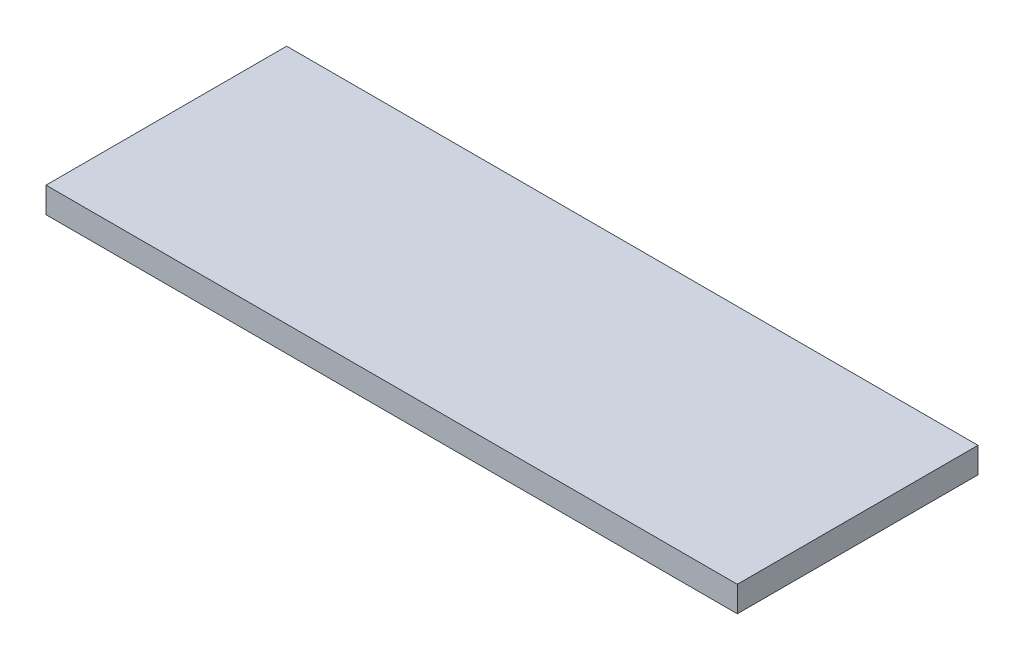
ISO-10303-21;
HEADER;
FILE_DESCRIPTION(('STEP AP214'),'2;1');
FILE_NAME('part.step','',(''),(''),'','','');
FILE_SCHEMA(('AUTOMOTIVE_DESIGN { 1 0 10303 214 1 1 1 1 }'));
ENDSEC;
DATA;
#1=APPLICATION_CONTEXT('core data for automotive mechanical design processes');
#2=APPLICATION_PROTOCOL_DEFINITION('international standard','automotive_design',2000,#1);
#3=PRODUCT_CONTEXT('',#1,'mechanical');
#4=PRODUCT('Part','Part','',(#3));
#5=PRODUCT_RELATED_PRODUCT_CATEGORY('part','',(#4));
#6=PRODUCT_DEFINITION_FORMATION('','',#4);
#7=PRODUCT_DEFINITION_CONTEXT('part definition',#1,'design');
#8=PRODUCT_DEFINITION('design','',#6,#7);
#9=PRODUCT_DEFINITION_SHAPE('','',#8);
#10=(LENGTH_UNIT() NAMED_UNIT(*) SI_UNIT(.MILLI.,.METRE.));
#11=(NAMED_UNIT(*) PLANE_ANGLE_UNIT() SI_UNIT($,.RADIAN.));
#12=(NAMED_UNIT(*) SI_UNIT($,.STERADIAN.) SOLID_ANGLE_UNIT());
#13=UNCERTAINTY_MEASURE_WITH_UNIT(LENGTH_MEASURE(1.E-05),#10,'distance_accuracy_value','');
#14=(GEOMETRIC_REPRESENTATION_CONTEXT(3) GLOBAL_UNCERTAINTY_ASSIGNED_CONTEXT((#13)) GLOBAL_UNIT_ASSIGNED_CONTEXT((#10,
#11,#12)) REPRESENTATION_CONTEXT('',''));
#15=CARTESIAN_POINT('',(0.,0.,0.));
#16=DIRECTION('',(0.,0.,1.));
#17=DIRECTION('',(1.,0.,0.));
#18=AXIS2_PLACEMENT_3D('',#15,#16,#17);
#19=CARTESIAN_POINT('',(-81.,6.00000000000001,-28.2));
#20=DIRECTION('',(0.,0.,-1.));
#21=DIRECTION('',(-1.,0.,0.));
#22=AXIS2_PLACEMENT_3D('',#19,#20,#21);
#23=PLANE('',#22);
#24=DIRECTION('',(1.,0.,0.));
#25=VECTOR('',#24,1.);
#26=CARTESIAN_POINT('',(-81.,0.,-28.2));
#27=LINE('',#26,#25);
#28=CARTESIAN_POINT('',(-81.,0.,-28.2));
#29=VERTEX_POINT('',#28);
#30=CARTESIAN_POINT('',(81.,0.,-28.2));
#31=VERTEX_POINT('',#30);
#32=EDGE_CURVE('E113',#29,#31,#27,.T.);
#33=ORIENTED_EDGE('',*,*,#32,.F.);
#34=DIRECTION('',(0.,-1.,0.));
#35=VECTOR('',#34,1.);
#36=CARTESIAN_POINT('',(-81.,6.00000000000001,-28.2));
#37=LINE('',#36,#35);
#38=CARTESIAN_POINT('',(-81.,6.00000000000001,-28.2));
#39=VERTEX_POINT('',#38);
#40=EDGE_CURVE('E11',#39,#29,#37,.T.);
#41=ORIENTED_EDGE('',*,*,#40,.F.);
#42=DIRECTION('',(1.,0.,0.));
#43=VECTOR('',#42,1.);
#44=CARTESIAN_POINT('',(-81.,6.00000000000001,-28.2));
#45=LINE('',#44,#43);
#46=CARTESIAN_POINT('',(81.,6.00000000000001,-28.2));
#47=VERTEX_POINT('',#46);
#48=EDGE_CURVE('E106',#39,#47,#45,.T.);
#49=ORIENTED_EDGE('',*,*,#48,.T.);
#50=DIRECTION('',(0.,-1.,0.));
#51=VECTOR('',#50,1.);
#52=CARTESIAN_POINT('',(81.,6.00000000000001,-28.2));
#53=LINE('',#52,#51);
#54=EDGE_CURVE('E45',#47,#31,#53,.T.);
#55=ORIENTED_EDGE('',*,*,#54,.T.);
#56=EDGE_LOOP('',(#33,#41,#49,#55));
#57=FACE_BOUND('',#56,.T.);
#58=ADVANCED_FACE('F42',(#57),#23,.T.);
#59=CARTESIAN_POINT('',(-81.,6.00000000000001,-28.2));
#60=DIRECTION('',(1.,0.,0.));
#61=DIRECTION('',(0.,0.,-1.));
#62=AXIS2_PLACEMENT_3D('',#59,#60,#61);
#63=PLANE('',#62);
#64=DIRECTION('',(0.,0.,1.));
#65=VECTOR('',#64,1.);
#66=CARTESIAN_POINT('',(-81.,0.,-28.2));
#67=LINE('',#66,#65);
#68=CARTESIAN_POINT('',(-81.,0.,28.2));
#69=VERTEX_POINT('',#68);
#70=EDGE_CURVE('E76',#29,#69,#67,.T.);
#71=ORIENTED_EDGE('',*,*,#70,.T.);
#72=DIRECTION('',(0.,-1.,0.));
#73=VECTOR('',#72,1.);
#74=CARTESIAN_POINT('',(-81.,6.00000000000001,28.2));
#75=LINE('',#74,#73);
#76=CARTESIAN_POINT('',(-81.,6.00000000000001,28.2));
#77=VERTEX_POINT('',#76);
#78=EDGE_CURVE('E52',#77,#69,#75,.T.);
#79=ORIENTED_EDGE('',*,*,#78,.F.);
#80=DIRECTION('',(0.,0.,1.));
#81=VECTOR('',#80,1.);
#82=CARTESIAN_POINT('',(-81.,6.00000000000001,-28.2));
#83=LINE('',#82,#81);
#84=EDGE_CURVE('E93',#39,#77,#83,.T.);
#85=ORIENTED_EDGE('',*,*,#84,.F.);
#86=ORIENTED_EDGE('',*,*,#40,.T.);
#87=EDGE_LOOP('',(#71,#79,#85,#86));
#88=FACE_BOUND('',#87,.T.);
#89=ADVANCED_FACE('F129',(#88),#63,.F.);
#90=CARTESIAN_POINT('',(-81.,6.00000000000001,28.2));
#91=DIRECTION('',(0.,0.,-1.));
#92=DIRECTION('',(-1.,0.,0.));
#93=AXIS2_PLACEMENT_3D('',#90,#91,#92);
#94=PLANE('',#93);
#95=DIRECTION('',(1.,0.,0.));
#96=VECTOR('',#95,1.);
#97=CARTESIAN_POINT('',(-81.,0.,28.2));
#98=LINE('',#97,#96);
#99=CARTESIAN_POINT('',(81.,0.,28.2));
#100=VERTEX_POINT('',#99);
#101=EDGE_CURVE('E101',#69,#100,#98,.T.);
#102=ORIENTED_EDGE('',*,*,#101,.T.);
#103=DIRECTION('',(0.,-1.,0.));
#104=VECTOR('',#103,1.);
#105=CARTESIAN_POINT('',(81.,6.00000000000001,28.2));
#106=LINE('',#105,#104);
#107=CARTESIAN_POINT('',(81.,6.00000000000001,28.2));
#108=VERTEX_POINT('',#107);
#109=EDGE_CURVE('E98',#108,#100,#106,.T.);
#110=ORIENTED_EDGE('',*,*,#109,.F.);
#111=DIRECTION('',(1.,0.,0.));
#112=VECTOR('',#111,1.);
#113=CARTESIAN_POINT('',(-81.,6.00000000000001,28.2));
#114=LINE('',#113,#112);
#115=EDGE_CURVE('E88',#77,#108,#114,.T.);
#116=ORIENTED_EDGE('',*,*,#115,.F.);
#117=ORIENTED_EDGE('',*,*,#78,.T.);
#118=EDGE_LOOP('',(#102,#110,#116,#117));
#119=FACE_BOUND('',#118,.T.);
#120=ADVANCED_FACE('F99',(#119),#94,.F.);
#121=CARTESIAN_POINT('',(81.,6.00000000000001,-28.2));
#122=DIRECTION('',(1.,0.,0.));
#123=DIRECTION('',(0.,0.,-1.));
#124=AXIS2_PLACEMENT_3D('',#121,#122,#123);
#125=PLANE('',#124);
#126=DIRECTION('',(0.,0.,1.));
#127=VECTOR('',#126,1.);
#128=CARTESIAN_POINT('',(81.,0.,-28.2));
#129=LINE('',#128,#127);
#130=EDGE_CURVE('E117',#31,#100,#129,.T.);
#131=ORIENTED_EDGE('',*,*,#130,.F.);
#132=ORIENTED_EDGE('',*,*,#54,.F.);
#133=DIRECTION('',(0.,0.,1.));
#134=VECTOR('',#133,1.);
#135=CARTESIAN_POINT('',(81.,6.00000000000001,-28.2));
#136=LINE('',#135,#134);
#137=EDGE_CURVE('E92',#47,#108,#136,.T.);
#138=ORIENTED_EDGE('',*,*,#137,.T.);
#139=ORIENTED_EDGE('',*,*,#109,.T.);
#140=EDGE_LOOP('',(#131,#132,#138,#139));
#141=FACE_BOUND('',#140,.T.);
#142=ADVANCED_FACE('F104',(#141),#125,.T.);
#143=CARTESIAN_POINT('',(0.,6.00000000000001,0.));
#144=DIRECTION('',(0.,-1.,0.));
#145=DIRECTION('',(0.,0.,-1.));
#146=AXIS2_PLACEMENT_3D('',#143,#144,#145);
#147=PLANE('',#146);
#148=ORIENTED_EDGE('',*,*,#48,.F.);
#149=ORIENTED_EDGE('',*,*,#84,.T.);
#150=ORIENTED_EDGE('',*,*,#115,.T.);
#151=ORIENTED_EDGE('',*,*,#137,.F.);
#152=EDGE_LOOP('',(#148,#149,#150,#151));
#153=FACE_BOUND('',#152,.T.);
#154=ADVANCED_FACE('F91',(#153),#147,.F.);
#155=CARTESIAN_POINT('',(0.,0.,0.));
#156=DIRECTION('',(0.,-1.,0.));
#157=DIRECTION('',(0.,0.,-1.));
#158=AXIS2_PLACEMENT_3D('',#155,#156,#157);
#159=PLANE('',#158);
#160=ORIENTED_EDGE('',*,*,#32,.T.);
#161=ORIENTED_EDGE('',*,*,#130,.T.);
#162=ORIENTED_EDGE('',*,*,#101,.F.);
#163=ORIENTED_EDGE('',*,*,#70,.F.);
#164=EDGE_LOOP('',(#160,#161,#162,#163));
#165=FACE_BOUND('',#164,.T.);
#166=ADVANCED_FACE('F126',(#165),#159,.T.);
#167=CLOSED_SHELL('',(#58,#89,#120,#142,#154,#166));
#168=MANIFOLD_SOLID_BREP('B2',#167);
#169=ADVANCED_BREP_SHAPE_REPRESENTATION('',(#18,#168),#14);
#170=SHAPE_DEFINITION_REPRESENTATION(#9,#169);
ENDSEC;
END-ISO-10303-21;
